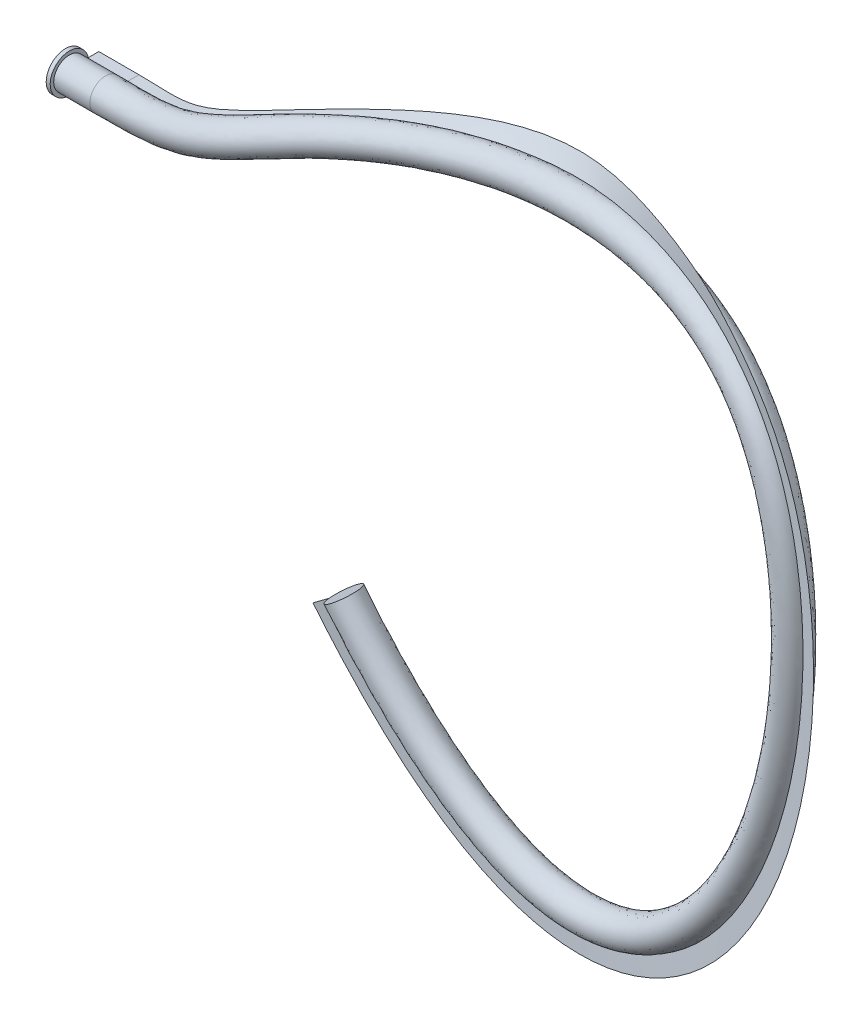
ISO-10303-21;
HEADER;
FILE_DESCRIPTION(('STEP AP214'),'2;1');
FILE_NAME('part.step','',(''),(''),'','','');
FILE_SCHEMA(('AUTOMOTIVE_DESIGN { 1 0 10303 214 1 1 1 1 }'));
ENDSEC;
DATA;
#1=APPLICATION_CONTEXT('core data for automotive mechanical design processes');
#2=APPLICATION_PROTOCOL_DEFINITION('international standard','automotive_design',2000,#1);
#3=PRODUCT_CONTEXT('',#1,'mechanical');
#4=PRODUCT('Part','Part','',(#3));
#5=PRODUCT_RELATED_PRODUCT_CATEGORY('part','',(#4));
#6=PRODUCT_DEFINITION_FORMATION('','',#4);
#7=PRODUCT_DEFINITION_CONTEXT('part definition',#1,'design');
#8=PRODUCT_DEFINITION('design','',#6,#7);
#9=PRODUCT_DEFINITION_SHAPE('','',#8);
#10=(LENGTH_UNIT() NAMED_UNIT(*) SI_UNIT(.MILLI.,.METRE.));
#11=(NAMED_UNIT(*) PLANE_ANGLE_UNIT() SI_UNIT($,.RADIAN.));
#12=(NAMED_UNIT(*) SI_UNIT($,.STERADIAN.) SOLID_ANGLE_UNIT());
#13=UNCERTAINTY_MEASURE_WITH_UNIT(LENGTH_MEASURE(1.E-05),#10,'distance_accuracy_value','');
#14=(GEOMETRIC_REPRESENTATION_CONTEXT(3) GLOBAL_UNCERTAINTY_ASSIGNED_CONTEXT((#13)) GLOBAL_UNIT_ASSIGNED_CONTEXT((#10,
#11,#12)) REPRESENTATION_CONTEXT('',''));
#15=CARTESIAN_POINT('',(0.,0.,0.));
#16=DIRECTION('',(0.,0.,1.));
#17=DIRECTION('',(1.,0.,0.));
#18=AXIS2_PLACEMENT_3D('',#15,#16,#17);
#19=CARTESIAN_POINT('',(0.,0.,0.));
#20=DIRECTION('',(0.,-1.,0.));
#21=DIRECTION('',(0.,0.,-1.));
#22=AXIS2_PLACEMENT_3D('',#19,#20,#21);
#23=PLANE('',#22);
#24=DIRECTION('',(0.,0.,-1.));
#25=VECTOR('',#24,1.);
#26=CARTESIAN_POINT('',(0.,0.,-12.4995326344575));
#27=LINE('',#26,#25);
#28=CARTESIAN_POINT('',(0.,0.,0.));
#29=VERTEX_POINT('',#28);
#30=CARTESIAN_POINT('',(0.,0.,-24.9990652689149));
#31=VERTEX_POINT('',#30);
#32=EDGE_CURVE('E13',#29,#31,#27,.T.);
#33=ORIENTED_EDGE('',*,*,#32,.T.);
#34=DIRECTION('',(1.,0.,0.));
#35=VECTOR('',#34,1.);
#36=CARTESIAN_POINT('',(15.0508166081988,0.,-24.9990652689149));
#37=LINE('',#36,#35);
#38=CARTESIAN_POINT('',(30.1016332163976,0.,-24.9990652689149));
#39=VERTEX_POINT('',#38);
#40=EDGE_CURVE('E111',#31,#39,#37,.T.);
#41=ORIENTED_EDGE('',*,*,#40,.T.);
#42=DIRECTION('',(0.,0.,1.));
#43=VECTOR('',#42,1.);
#44=CARTESIAN_POINT('',(30.1016332163976,0.,-12.4995326344575));
#45=LINE('',#44,#43);
#46=CARTESIAN_POINT('',(30.1016332163976,0.,0.));
#47=VERTEX_POINT('',#46);
#48=EDGE_CURVE('E151',#39,#47,#45,.T.);
#49=ORIENTED_EDGE('',*,*,#48,.T.);
#50=DIRECTION('',(-1.,0.,0.));
#51=VECTOR('',#50,1.);
#52=CARTESIAN_POINT('',(15.0508166081988,0.,0.));
#53=LINE('',#52,#51);
#54=EDGE_CURVE('E153',#47,#29,#53,.T.);
#55=ORIENTED_EDGE('',*,*,#54,.T.);
#56=EDGE_LOOP('',(#33,#41,#49,#55));
#57=FACE_BOUND('',#56,.T.);
#58=ADVANCED_FACE('F103',(#57),#23,.T.);
#59=CARTESIAN_POINT('',(30.1016332163976,0.,0.));
#60=CARTESIAN_POINT('',(55.5468298114233,0.,0.));
#61=CARTESIAN_POINT('',(70.1959087110499,-4.28928661139099,-3.59783484335196));
#62=CARTESIAN_POINT('',(98.3097393803761,-5.5096578882017,-20.1579675410011));
#63=CARTESIAN_POINT('',(113.240531170058,-2.7947658399408,-33.5370180049418));
#64=CARTESIAN_POINT('',(146.632942624987,4.00335387971831,-54.2279027795051));
#65=CARTESIAN_POINT('',(185.690439633622,12.5828522392884,-69.3386516581471));
#66=CARTESIAN_POINT('',(248.064171203921,24.7591159779145,-77.575086725589));
#67=CARTESIAN_POINT('',(312.065258336305,32.7646820646166,-76.0468620606256));
#68=CARTESIAN_POINT('',(362.859164352378,32.6018188310675,-69.7126014350588));
#69=CARTESIAN_POINT('',(399.632211471097,26.355875103229,-63.4546347150911));
#70=CARTESIAN_POINT('',(424.696488528669,18.1098026974709,-58.6273520211944));
#71=CARTESIAN_POINT('',(441.741028211034,8.55596162751169,-55.1355978993468));
#72=CARTESIAN_POINT('',(454.752871671824,-1.67436745328666,-52.4851845901089));
#73=CARTESIAN_POINT('',(468.425955271432,-15.4509263472259,-49.7587908768161));
#74=CARTESIAN_POINT('',(483.768604324146,-39.9448857484107,-46.8472460429881));
#75=CARTESIAN_POINT('',(495.752881352239,-75.3259260325674,-44.7459070807219));
#76=CARTESIAN_POINT('',(501.667481394094,-115.158213425079,-43.8420019327744));
#77=CARTESIAN_POINT('',(501.859614848887,-162.602470687242,-43.9575509822502));
#78=CARTESIAN_POINT('',(494.351450877478,-216.621816096839,-45.2515824799837));
#79=CARTESIAN_POINT('',(477.313875924743,-274.080432822978,-47.6688568933928));
#80=CARTESIAN_POINT('',(452.206924849374,-326.313508699455,-50.6424679806723));
#81=CARTESIAN_POINT('',(423.407944671285,-364.761128649058,-53.3808508663713));
#82=CARTESIAN_POINT('',(393.986523136635,-390.149623686739,-55.5551413090203));
#83=CARTESIAN_POINT('',(366.103223689863,-405.139587422326,-57.1336149651727));
#84=CARTESIAN_POINT('',(335.785348925851,-412.245662508417,-58.2937686026919));
#85=CARTESIAN_POINT('',(306.876826910624,-410.565574709895,-58.8348507950215));
#86=CARTESIAN_POINT('',(280.302523126652,-402.543718859755,-58.8646063924169));
#87=CARTESIAN_POINT('',(256.71553757486,-390.845627953381,-58.5464238900332));
#88=CARTESIAN_POINT('',(232.38779679188,-373.995756595483,-57.8451122645308));
#89=CARTESIAN_POINT('',(207.38755642634,-351.664538797934,-56.7212296929423));
#90=CARTESIAN_POINT('',(181.783072126868,-323.522408572607,-55.1353343523003));
#91=CARTESIAN_POINT('',(164.356090403685,-300.667336145118,-53.7437677305249));
#92=CARTESIAN_POINT('',(155.564644102647,-288.161459197369,-52.9578350171391));
#93=CARTESIAN_POINT('',(30.1016332163976,0.,-24.9990652689149));
#94=CARTESIAN_POINT('',(51.2066463631746,0.,-24.9990652689149));
#95=CARTESIAN_POINT('',(60.0449059639529,-3.90932476682724,-26.1958832214973));
#96=CARTESIAN_POINT('',(83.2787257879151,-5.3902200228475,-40.7047793964273));
#97=CARTESIAN_POINT('',(98.6924087908258,-3.29960154311356,-54.2634156943438));
#98=CARTESIAN_POINT('',(135.151111777136,4.82705807837612,-76.240079899013));
#99=CARTESIAN_POINT('',(179.310164376356,18.1219920870578,-93.5517466398552));
#100=CARTESIAN_POINT('',(244.845057214882,38.460048819118,-99.3036164095549));
#101=CARTESIAN_POINT('',(311.413023428426,56.2856128406427,-87.6747431436239));
#102=CARTESIAN_POINT('',(364.859429325503,57.7203334266527,-72.1518402759851));
#103=CARTESIAN_POINT('',(405.053098130135,50.7783388132778,-61.108660646671));
#104=CARTESIAN_POINT('',(433.517263238505,41.1046699991074,-53.4426134879953));
#105=CARTESIAN_POINT('',(453.70526988275,29.4015121314106,-47.8319429461425));
#106=CARTESIAN_POINT('',(469.601721228006,16.6848629983963,-44.1364201396492));
#107=CARTESIAN_POINT('',(486.545265874564,-0.371148983291283,-40.7305787735882));
#108=CARTESIAN_POINT('',(504.786769619765,-29.5664926385407,-37.5659271811336));
#109=CARTESIAN_POINT('',(518.443484922547,-69.7519116873188,-35.493014717398));
#110=CARTESIAN_POINT('',(525.058221217374,-113.460241850655,-34.948220403716));
#111=CARTESIAN_POINT('',(525.463049713009,-164.498216514142,-35.6773081109705));
#112=CARTESIAN_POINT('',(517.727738561476,-221.937402720238,-37.842007572168));
#113=CARTESIAN_POINT('',(499.901232459371,-282.978143252269,-41.2835331383025));
#114=CARTESIAN_POINT('',(473.195359157688,-339.051462263792,-45.2176151283149));
#115=CARTESIAN_POINT('',(441.691279153495,-381.457632165367,-48.717812231068));
#116=CARTESIAN_POINT('',(408.128267101386,-410.602089225049,-51.5174043528184));
#117=CARTESIAN_POINT('',(375.015442418389,-428.540701366268,-53.6017467679279));
#118=CARTESIAN_POINT('',(337.818430262657,-437.329373265218,-55.1867871496457));
#119=CARTESIAN_POINT('',(302.426537948316,-435.226249596591,-55.9614595510149));
#120=CARTESIAN_POINT('',(270.9549552637,-425.684854795165,-56.0850304806149));
#121=CARTESIAN_POINT('',(243.915939461113,-412.242138102371,-55.7921209009795));
#122=CARTESIAN_POINT('',(216.889464601843,-393.492278179499,-55.0809118143148));
#123=CARTESIAN_POINT('',(189.83854106263,-369.311184940678,-53.9359617089015));
#124=CARTESIAN_POINT('',(162.664859176167,-339.423172383067,-52.3057831277753));
#125=CARTESIAN_POINT('',(144.495964595939,-315.601896564142,-50.9311248144047));
#126=CARTESIAN_POINT('',(135.330804168195,-302.564409375917,-50.1117830181928));
#127=B_SPLINE_SURFACE_WITH_KNOTS('',1,3,((#59,#60,#61,#62,#63,#64,#65,#66,#67,#68,#69,#70,#71,
#72,#73,#74,#75,#76,#77,#78,#79,#80,#81,#82,#83,#84,#85,#86,#87,#88,#89,#90,#91,#92),(#93,#94,
#95,#96,#97,#98,#99,#100,#101,#102,#103,#104,#105,#106,#107,#108,#109,#110,#111,#112,#113,#114,
#115,#116,#117,#118,#119,#120,#121,#122,#123,#124,#125,#126)),.UNSPECIFIED.,.F.,.F.,.F.,(2,2),
(4,1,1,1,1,1,1,1,1,1,1,1,1,1,1,1,1,1,1,1,1,1,1,1,1,1,1,1,1,1,1,4),(0.,1.),(0.,0.052255648091725,
0.052734375,0.10073686332604,0.10546875,0.158203125,0.2109375,0.263671875,0.31640625,
0.3427734375,0.369140625,0.3955078125,0.404157126548899,0.421875,0.45703125,0.4921875,
0.52734375,0.5625,0.609375,0.65625,0.703125,0.75,0.78125,0.8125,0.84375,0.875,0.895833333333333,
0.916666666666667,0.9375,0.958333333333333,0.979166666666667,1.),.UNSPECIFIED.);
#128=CARTESIAN_POINT('',(30.1016332163976,0.,-24.9990652689149));
#129=CARTESIAN_POINT('',(51.2066463631746,0.,-24.9990652689149));
#130=CARTESIAN_POINT('',(60.0449059639529,-3.90932476682724,-26.1958832214973));
#131=CARTESIAN_POINT('',(83.2787257879151,-5.3902200228475,-40.7047793964273));
#132=CARTESIAN_POINT('',(98.6924087908258,-3.29960154311356,-54.2634156943438));
#133=CARTESIAN_POINT('',(135.151111777136,4.82705807837612,-76.240079899013));
#134=CARTESIAN_POINT('',(179.310164376356,18.1219920870578,-93.5517466398552));
#135=CARTESIAN_POINT('',(244.845057214882,38.460048819118,-99.3036164095549));
#136=CARTESIAN_POINT('',(311.413023428426,56.2856128406427,-87.6747431436239));
#137=CARTESIAN_POINT('',(364.859429325503,57.7203334266527,-72.1518402759851));
#138=CARTESIAN_POINT('',(405.053098130135,50.7783388132778,-61.108660646671));
#139=CARTESIAN_POINT('',(433.517263238505,41.1046699991074,-53.4426134879953));
#140=CARTESIAN_POINT('',(453.70526988275,29.4015121314106,-47.8319429461425));
#141=CARTESIAN_POINT('',(469.601721228006,16.6848629983963,-44.1364201396492));
#142=CARTESIAN_POINT('',(486.545265874564,-0.371148983291283,-40.7305787735882));
#143=CARTESIAN_POINT('',(504.786769619765,-29.5664926385407,-37.5659271811336));
#144=CARTESIAN_POINT('',(518.443484922547,-69.7519116873188,-35.493014717398));
#145=CARTESIAN_POINT('',(525.058221217374,-113.460241850655,-34.948220403716));
#146=CARTESIAN_POINT('',(525.463049713009,-164.498216514142,-35.6773081109705));
#147=CARTESIAN_POINT('',(517.727738561476,-221.937402720238,-37.842007572168));
#148=CARTESIAN_POINT('',(499.901232459371,-282.978143252269,-41.2835331383025));
#149=CARTESIAN_POINT('',(473.195359157688,-339.051462263792,-45.2176151283149));
#150=CARTESIAN_POINT('',(441.691279153495,-381.457632165367,-48.717812231068));
#151=CARTESIAN_POINT('',(408.128267101386,-410.602089225049,-51.5174043528184));
#152=CARTESIAN_POINT('',(375.015442418389,-428.540701366268,-53.6017467679279));
#153=CARTESIAN_POINT('',(337.818430262657,-437.329373265218,-55.1867871496457));
#154=CARTESIAN_POINT('',(302.426537948316,-435.226249596591,-55.9614595510149));
#155=CARTESIAN_POINT('',(270.9549552637,-425.684854795165,-56.0850304806149));
#156=CARTESIAN_POINT('',(243.915939461113,-412.242138102371,-55.7921209009795));
#157=CARTESIAN_POINT('',(216.889464601843,-393.492278179499,-55.0809118143148));
#158=CARTESIAN_POINT('',(189.83854106263,-369.311184940678,-53.9359617089015));
#159=CARTESIAN_POINT('',(162.664859176167,-339.423172383067,-52.3057831277753));
#160=CARTESIAN_POINT('',(144.495964595939,-315.601896564142,-50.9311248144047));
#161=CARTESIAN_POINT('',(135.330804168195,-302.564409375917,-50.1117830181928));
#162=B_SPLINE_CURVE_WITH_KNOTS('',3,(#128,#129,#130,#131,#132,#133,#134,#135,#136,#137,#138,
#139,#140,#141,#142,#143,#144,#145,#146,#147,#148,#149,#150,#151,#152,#153,#154,#155,#156,#157,
#158,#159,#160,#161),.UNSPECIFIED.,.F.,.F.,(4,1,1,1,1,1,1,1,1,1,1,1,1,1,1,1,1,1,1,1,1,1,1,1,1,1,
1,1,1,1,1,4),(0.,0.052255648091725,0.052734375,0.10073686332604,0.10546875,0.158203125,
0.2109375,0.263671875,0.31640625,0.3427734375,0.369140625,0.3955078125,0.404157126548899,
0.421875,0.45703125,0.4921875,0.52734375,0.5625,0.609375,0.65625,0.703125,0.75,0.78125,0.8125,
0.84375,0.875,0.895833333333333,0.916666666666667,0.9375,0.958333333333333,0.979166666666667,
1.),.UNSPECIFIED.);
#163=CARTESIAN_POINT('',(135.330804168195,-302.564409375917,-50.1117830181928));
#164=VERTEX_POINT('',#163);
#165=EDGE_CURVE('E132',#39,#164,#162,.T.);
#166=DIRECTION('',(0.809383859628205,0.57613954856375,-0.113846336586242));
#167=VECTOR('',#166,1.);
#168=CARTESIAN_POINT('',(145.447724135421,-295.362934286643,-51.534809017666));
#169=LINE('',#168,#167);
#170=CARTESIAN_POINT('',(155.564644102647,-288.161459197369,-52.9578350171391));
#171=VERTEX_POINT('',#170);
#172=EDGE_CURVE('E105',#164,#171,#169,.T.);
#173=CARTESIAN_POINT('',(30.1016332163976,0.,0.));
#174=CARTESIAN_POINT('',(55.5468298114233,0.,0.));
#175=CARTESIAN_POINT('',(70.1959087110499,-4.28928661139099,-3.59783484335196));
#176=CARTESIAN_POINT('',(98.3097393803761,-5.5096578882017,-20.1579675410011));
#177=CARTESIAN_POINT('',(113.240531170058,-2.7947658399408,-33.5370180049418));
#178=CARTESIAN_POINT('',(146.632942624987,4.00335387971831,-54.2279027795051));
#179=CARTESIAN_POINT('',(185.690439633622,12.5828522392884,-69.3386516581471));
#180=CARTESIAN_POINT('',(248.064171203921,24.7591159779145,-77.575086725589));
#181=CARTESIAN_POINT('',(312.065258336305,32.7646820646166,-76.0468620606256));
#182=CARTESIAN_POINT('',(362.859164352378,32.6018188310675,-69.7126014350588));
#183=CARTESIAN_POINT('',(399.632211471097,26.355875103229,-63.4546347150911));
#184=CARTESIAN_POINT('',(424.696488528669,18.1098026974709,-58.6273520211944));
#185=CARTESIAN_POINT('',(441.741028211034,8.55596162751169,-55.1355978993468));
#186=CARTESIAN_POINT('',(454.752871671824,-1.67436745328666,-52.4851845901089));
#187=CARTESIAN_POINT('',(468.425955271432,-15.4509263472259,-49.7587908768161));
#188=CARTESIAN_POINT('',(483.768604324146,-39.9448857484107,-46.8472460429881));
#189=CARTESIAN_POINT('',(495.752881352239,-75.3259260325674,-44.7459070807219));
#190=CARTESIAN_POINT('',(501.667481394094,-115.158213425079,-43.8420019327744));
#191=CARTESIAN_POINT('',(501.859614848887,-162.602470687242,-43.9575509822502));
#192=CARTESIAN_POINT('',(494.351450877478,-216.621816096839,-45.2515824799837));
#193=CARTESIAN_POINT('',(477.313875924743,-274.080432822978,-47.6688568933928));
#194=CARTESIAN_POINT('',(452.206924849374,-326.313508699455,-50.6424679806723));
#195=CARTESIAN_POINT('',(423.407944671285,-364.761128649058,-53.3808508663713));
#196=CARTESIAN_POINT('',(393.986523136635,-390.149623686739,-55.5551413090203));
#197=CARTESIAN_POINT('',(366.103223689863,-405.139587422326,-57.1336149651727));
#198=CARTESIAN_POINT('',(335.785348925851,-412.245662508417,-58.2937686026919));
#199=CARTESIAN_POINT('',(306.876826910624,-410.565574709895,-58.8348507950215));
#200=CARTESIAN_POINT('',(280.302523126652,-402.543718859755,-58.8646063924169));
#201=CARTESIAN_POINT('',(256.71553757486,-390.845627953381,-58.5464238900332));
#202=CARTESIAN_POINT('',(232.38779679188,-373.995756595483,-57.8451122645308));
#203=CARTESIAN_POINT('',(207.38755642634,-351.664538797934,-56.7212296929423));
#204=CARTESIAN_POINT('',(181.783072126868,-323.522408572607,-55.1353343523003));
#205=CARTESIAN_POINT('',(164.356090403685,-300.667336145118,-53.7437677305249));
#206=CARTESIAN_POINT('',(155.564644102647,-288.161459197369,-52.9578350171391));
#207=B_SPLINE_CURVE_WITH_KNOTS('',3,(#173,#174,#175,#176,#177,#178,#179,#180,#181,#182,#183,
#184,#185,#186,#187,#188,#189,#190,#191,#192,#193,#194,#195,#196,#197,#198,#199,#200,#201,#202,
#203,#204,#205,#206),.UNSPECIFIED.,.F.,.F.,(4,1,1,1,1,1,1,1,1,1,1,1,1,1,1,1,1,1,1,1,1,1,1,1,1,1,
1,1,1,1,1,4),(0.,0.052255648091725,0.052734375,0.10073686332604,0.10546875,0.158203125,
0.2109375,0.263671875,0.31640625,0.3427734375,0.369140625,0.3955078125,0.404157126548899,
0.421875,0.45703125,0.4921875,0.52734375,0.5625,0.609375,0.65625,0.703125,0.75,0.78125,0.8125,
0.84375,0.875,0.895833333333333,0.916666666666667,0.9375,0.958333333333333,0.979166666666667,
1.),.UNSPECIFIED.);
#208=EDGE_CURVE('E120',#171,#47,#207,.F.);
#209=ORIENTED_EDGE('',*,*,#48,.F.);
#210=ORIENTED_EDGE('',*,*,#165,.T.);
#211=ORIENTED_EDGE('',*,*,#172,.T.);
#212=ORIENTED_EDGE('',*,*,#208,.T.);
#213=EDGE_LOOP('',(#209,#210,#211,#212));
#214=FACE_BOUND('',#213,.T.);
#215=ADVANCED_FACE('F134',(#214),#127,.T.);
#216=OPEN_SHELL('',(#58,#215));
#217=SHELL_BASED_SURFACE_MODEL('B2',(#216));
#218=CARTESIAN_POINT('',(0.,0.,0.));
#219=DIRECTION('',(1.,0.,0.));
#220=DIRECTION('',(0.,0.,-1.));
#221=AXIS2_PLACEMENT_3D('',#218,#219,#220);
#222=CYLINDRICAL_SURFACE('',#221,11.798578456208);
#223=CARTESIAN_POINT('',(30.1016332163976,0.,0.));
#224=DIRECTION('',(1.,0.,0.));
#225=DIRECTION('',(0.,0.,-1.));
#226=AXIS2_PLACEMENT_3D('',#223,#224,#225);
#227=CIRCLE('',#226,11.798578456208);
#228=CARTESIAN_POINT('',(30.1016332163976,0.,-11.798578456208));
#229=VERTEX_POINT('',#228);
#230=EDGE_CURVE('E102',#229,#229,#227,.T.);
#231=ORIENTED_EDGE('',*,*,#230,.F.);
#232=EDGE_LOOP('',(#231));
#233=FACE_BOUND('',#232,.T.);
#234=CARTESIAN_POINT('',(3.,0.,0.));
#235=DIRECTION('',(-1.,0.,0.));
#236=DIRECTION('',(0.,0.,1.));
#237=AXIS2_PLACEMENT_3D('',#234,#235,#236);
#238=CIRCLE('',#237,11.798578456208);
#239=CARTESIAN_POINT('',(3.,0.,11.798578456208));
#240=VERTEX_POINT('',#239);
#241=EDGE_CURVE('E199',#240,#240,#238,.F.);
#242=ORIENTED_EDGE('',*,*,#241,.T.);
#243=EDGE_LOOP('',(#242));
#244=FACE_BOUND('',#243,.T.);
#245=ADVANCED_FACE('F196',(#233,#244),#222,.T.);
#246=CARTESIAN_POINT('',(155.564644102647,-288.161459197368,-52.9578350171388));
#247=DIRECTION('',(-0.574341651577695,0.817003912058257,0.0513446681215159));
#248=DIRECTION('',(-0.809383859628204,-0.576139548563751,0.113846336586242));
#249=AXIS2_PLACEMENT_3D('',#246,#247,#248);
#250=PLANE('',#249);
#251=CARTESIAN_POINT('',(155.564644102647,-288.161459197368,-52.9578350171388));
#252=DIRECTION('',(-0.574341651577695,0.817003912058257,0.0513446681215159));
#253=DIRECTION('',(-0.809383859628204,-0.576139548563751,0.113846336586242));
#254=AXIS2_PLACEMENT_3D('',#251,#252,#253);
#255=CIRCLE('',#254,11.798578456208);
#256=CARTESIAN_POINT('',(146.015065133636,-294.959086862822,-51.6146100829742));
#257=VERTEX_POINT('',#256);
#258=EDGE_CURVE('E203',#257,#257,#255,.T.);
#259=ORIENTED_EDGE('',*,*,#258,.T.);
#260=EDGE_LOOP('',(#259));
#261=FACE_BOUND('',#260,.T.);
#262=ADVANCED_FACE('F234',(#261),#250,.T.);
#263=CARTESIAN_POINT('',(30.1016332163976,0.,-11.798578456208));
#264=CARTESIAN_POINT('',(55.5476186814989,0.,-11.798578456208));
#265=CARTESIAN_POINT('',(65.9728837938179,-4.10995952114873,-14.2632274841827));
#266=CARTESIAN_POINT('',(90.708402752645,-5.45328789956953,-29.8552569833641));
#267=CARTESIAN_POINT('',(106.189518537636,-3.03302849445633,-43.3190649183939));
#268=CARTESIAN_POINT('',(141.372193254795,4.39210995951688,-64.6167871614904));
#269=CARTESIAN_POINT('',(182.610284980642,15.1971090273244,-80.7662829610074));
#270=CARTESIAN_POINT('',(246.563370788906,31.2254189900988,-87.8301006413731));
#271=CARTESIAN_POINT('',(311.752363380052,43.8656390059569,-81.534765938688));
#272=CARTESIAN_POINT('',(363.803839603014,44.4567726851997,-70.8638265120173));
#273=CARTESIAN_POINT('',(402.190538998434,37.8823202353672,-62.3474269533313));
#274=CARTESIAN_POINT('',(428.85957998228,28.962478308741,-56.1803587556124));
#275=CARTESIAN_POINT('',(447.387681668277,18.3942439967641,-51.6885591778793));
#276=CARTESIAN_POINT('',(461.760942532586,6.99046935360578,-48.5448951704222));
#277=CARTESIAN_POINT('',(476.977562061572,-8.33386279236788,-45.4978288098984));
#278=CARTESIAN_POINT('',(493.688353176079,-35.0466911945485,-42.4668275117174));
#279=CARTESIAN_POINT('',(506.461956662736,-72.6952098487024,-40.3789047419473));
#280=CARTESIAN_POINT('',(512.70699324683,-114.356837431132,-39.6444858252541));
#281=CARTESIAN_POINT('',(512.999510501614,-163.497188364772,-40.0496010601912));
#282=CARTESIAN_POINT('',(505.384141981025,-219.130564581928,-41.7545536969235));
#283=CARTESIAN_POINT('',(487.974222301005,-278.279803024488,-44.6552344724933));
#284=CARTESIAN_POINT('',(462.112643276519,-332.325323976446,-48.0821502178843));
#285=CARTESIAN_POINT('',(432.036959934697,-372.641221239419,-51.1800793488499));
#286=CARTESIAN_POINT('',(400.660875571386,-399.802390856563,-53.6494881525222));
#287=CARTESIAN_POINT('',(370.309426836316,-416.183974754221,-55.4667103751569));
#288=CARTESIAN_POINT('',(336.744938115023,-424.084267879704,-56.8274000731981));
#289=CARTESIAN_POINT('',(304.776290201757,-422.20419746656,-57.4787071791582));
#290=CARTESIAN_POINT('',(275.891253557448,-413.466019139512,-57.5527927442225));
#291=CARTESIAN_POINT('',(250.673056086035,-400.941703895352,-57.2463602575154));
#292=CARTESIAN_POINT('',(225.079068367196,-383.205709702508,-56.5410434039459));
#293=CARTESIAN_POINT('',(199.083176112729,-359.9618635885,-55.4047316534655));
#294=CARTESIAN_POINT('',(172.841881771136,-331.143386717085,-53.8072148908379));
#295=CARTESIAN_POINT('',(154.806513688038,-307.464967015995,-52.4005429978053));
#296=CARTESIAN_POINT('',(146.015065133635,-294.959086862822,-51.6146100829745));
#297=CARTESIAN_POINT('',(30.1016332163976,23.597156912416,-11.798578456208));
#298=CARTESIAN_POINT('',(61.6990032516399,23.597156912416,-11.798578456208));
#299=CARTESIAN_POINT('',(69.1180638556201,19.5248925409228,-14.7724994981416));
#300=CARTESIAN_POINT('',(89.480992149267,18.0801107091123,-29.8335300343747));
#301=CARTESIAN_POINT('',(103.402810919764,20.3614445748145,-42.2754654121536));
#302=CARTESIAN_POINT('',(137.453928832869,27.5014063665857,-61.2876276357711));
#303=CARTESIAN_POINT('',(179.778513551476,38.0167931203063,-74.9029422551506));
#304=CARTESIAN_POINT('',(244.223850313923,51.6289655759233,-74.5621432484984));
#305=CARTESIAN_POINT('',(309.838131783552,54.6799028942448,-59.4472749434804));
#306=CARTESIAN_POINT('',(360.824837232796,46.9223017848143,-47.3907313807583));
#307=CARTESIAN_POINT('',(397.766698271059,36.6042568014699,-39.1616869682762));
#308=CARTESIAN_POINT('',(423.161280867935,25.9609889426634,-33.4444873180707));
#309=CARTESIAN_POINT('',(440.3902052791,14.5758260465204,-29.4738227582075));
#310=CARTESIAN_POINT('',(453.993432887083,3.26029429315646,-26.571808462533));
#311=CARTESIAN_POINT('',(468.584277676536,-11.4746082442471,-23.6615953378242));
#312=CARTESIAN_POINT('',(484.997085778159,-37.1683091827344,-20.6214356729075));
#313=CARTESIAN_POINT('',(497.758018884046,-73.8456595230765,-18.4702081929353));
#314=CARTESIAN_POINT('',(504.315360649713,-114.728273258422,-17.5878918251665));
#315=CARTESIAN_POINT('',(505.178609159269,-163.211099156859,-17.7813880837857));
#316=CARTESIAN_POINT('',(498.389949883388,-218.331431214289,-19.2228945684598));
#317=CARTESIAN_POINT('',(481.962006930384,-277.083517169354,-21.8598855982213));
#318=CARTESIAN_POINT('',(457.056861527401,-330.759160790736,-25.0784369887839));
#319=CARTESIAN_POINT('',(427.85487930872,-370.650604108366,-28.034134821229));
#320=CARTESIAN_POINT('',(397.428854959249,-397.361117382589,-30.3954130742282));
#321=CARTESIAN_POINT('',(368.120529038991,-413.382359597642,-32.1284480941093));
#322=CARTESIAN_POINT('',(335.840583727827,-421.128019185759,-33.4208310891567));
#323=CARTESIAN_POINT('',(305.042187147079,-419.43733555091,-34.037710515772));
#324=CARTESIAN_POINT('',(277.023127943738,-411.06303121489,-34.1017819824482));
#325=CARTESIAN_POINT('',(252.394842545483,-398.913328031947,-33.7960557231714));
#326=CARTESIAN_POINT('',(227.271988210579,-381.606937120433,-33.0997544147405));
#327=CARTESIAN_POINT('',(201.528435107923,-358.647963823217,-31.9663531617896));
#328=CARTESIAN_POINT('',(175.805243041149,-330.569818551074,-30.4053195043266));
#329=CARTESIAN_POINT('',(157.170276217859,-306.149989019511,-28.9408327516767));
#330=CARTESIAN_POINT('',(148.907949058601,-294.396786734294,-28.2022019302168));
#331=CARTESIAN_POINT('',(30.1016332163976,23.597156912416,11.798578456208));
#332=CARTESIAN_POINT('',(61.6990032516399,23.597156912416,11.798578456208));
#333=CARTESIAN_POINT('',(77.5645508981014,19.1662383604382,6.55828578351985));
#334=CARTESIAN_POINT('',(104.68327482603,17.967370731848,-10.4389511496488));
#335=CARTESIAN_POINT('',(117.504693847138,20.8379698838456,-22.7113715852493));
#336=CARTESIAN_POINT('',(147.975549395907,26.7238942069885,-40.5098588718006));
#337=CARTESIAN_POINT('',(185.938769797391,32.7882795442343,-52.0476796494301));
#338=CARTESIAN_POINT('',(247.225465384021,38.6963595515546,-54.0521154169302));
#339=CARTESIAN_POINT('',(310.463917795829,32.4779890115643,-48.4714671873558));
#340=CARTESIAN_POINT('',(358.935487215523,23.2123940765498,-45.0882812268412));
#341=CARTESIAN_POINT('',(392.650043125229,13.5513665371934,-41.376102491796));
#342=CARTESIAN_POINT('',(414.835097985122,4.2556377201231,-38.3384738492346));
#343=CARTESIAN_POINT('',(429.096898365055,-5.10073869198444,-36.3679002011426));
#344=CARTESIAN_POINT('',(439.977291162615,-14.0693793206284,-34.4523873019063));
#345=CARTESIAN_POINT('',(451.481064098369,-25.7087353539631,-32.1835194716595));
#346=CARTESIAN_POINT('',(465.157588073577,-46.9646982904589,-29.382272735449));
#347=CARTESIAN_POINT('',(476.339868263243,-79.1070918908066,-27.2042128704844));
#348=CARTESIAN_POINT('',(482.236336944189,-116.331025246315,-25.9829240402071));
#349=CARTESIAN_POINT('',(482.898817853835,-161.421663801798,-25.5972879279039));
#350=CARTESIAN_POINT('',(476.324567676287,-213.31393424411,-26.2169521345801));
#351=CARTESIAN_POINT('',(460.641314177864,-268.684776766339,-27.8871304400206));
#352=CARTESIAN_POINT('',(437.245424673097,-318.735530236735,-30.1990725143588));
#353=CARTESIAN_POINT('',(410.596848781938,-354.890418927704,-32.4356778562756));
#354=CARTESIAN_POINT('',(384.080150089649,-378.055583042801,-34.2067193872156));
#355=CARTESIAN_POINT('',(359.708122746458,-391.293584934384,-35.4622572741742));
#356=CARTESIAN_POINT('',(333.921405348089,-397.450808441202,-36.3535681480196));
#357=CARTESIAN_POINT('',(309.243260569279,-396.160090043935,-36.749997747898));
#358=CARTESIAN_POINT('',(285.845667071519,-389.21843064026,-36.7254092778872));
#359=CARTESIAN_POINT('',(264.47980556333,-378.721176205184,-36.3961829918006));
#360=CARTESIAN_POINT('',(241.88944490979,-363.187030692783,-35.7078921224866));
#361=CARTESIAN_POINT('',(218.137196295579,-342.053315039307,-34.5993492908447));
#362=CARTESIAN_POINT('',(193.687621661034,-315.327859286835,-33.0615582402694));
#363=CARTESIAN_POINT('',(176.269434155882,-292.554733688604,-31.627282620006));
#364=CARTESIAN_POINT('',(168.007106996625,-280.801531403386,-30.8886517985461));
#365=CARTESIAN_POINT('',(30.1016332163976,0.,11.798578456208));
#366=CARTESIAN_POINT('',(58.6233109665694,0.,11.798578456208));
#367=CARTESIAN_POINT('',(75.2716767910484,-4.46861370163325,7.06755779747876));
#368=CARTESIAN_POINT('',(105.149280016965,-5.56602787683386,-10.4606780986382));
#369=CARTESIAN_POINT('',(120.013924683349,-2.55650318542527,-23.7549710914896));
#370=CARTESIAN_POINT('',(152.131298421776,3.61459779991973,-43.8390183975199));
#371=CARTESIAN_POINT('',(188.667104438622,9.96859545125235,-57.9110203552869));
#372=CARTESIAN_POINT('',(249.592745860649,18.2928129657302,-67.3200728098049));
#373=CARTESIAN_POINT('',(312.370546173687,21.6637251232762,-70.5589581825633));
#374=CARTESIAN_POINT('',(361.915433110073,20.7468649769357,-68.5613763581002));
#375=CARTESIAN_POINT('',(397.073706152537,14.8294299710899,-64.5618424768511));
#376=CARTESIAN_POINT('',(420.533444681506,7.25712708620385,-61.0743452867761));
#377=CARTESIAN_POINT('',(436.094375612544,-1.28232074174921,-58.5826366208149));
#378=CARTESIAN_POINT('',(447.744795067388,-10.3392042601661,-56.4254740097948));
#379=CARTESIAN_POINT('',(459.874352600762,-22.5679899020612,-54.0197529437323));
#380=CARTESIAN_POINT('',(473.848854075864,-44.8430803025324,-51.2276645742752));
#381=CARTESIAN_POINT('',(485.043806415011,-77.9566422154731,-49.1129094194362));
#382=CARTESIAN_POINT('',(490.627969444629,-115.959589422603,-48.0395180405195));
#383=CARTESIAN_POINT('',(490.719719222068,-161.707752994479,-47.865500903352));
#384=CARTESIAN_POINT('',(483.318759818007,-214.113067690056,-48.748611267965));
#385=CARTESIAN_POINT('',(466.653529347919,-269.881062331983,-50.6824792960995));
#386=CARTESIAN_POINT('',(442.301207180397,-320.3016945021,-53.2027858113102));
#387=CARTESIAN_POINT('',(414.77892697468,-356.881032597273,-55.5816221663593));
#388=CARTESIAN_POINT('',(387.312176490026,-380.496864750618,-57.4607949829661));
#389=CARTESIAN_POINT('',(361.896998649562,-394.095168946311,-58.8005175979341));
#390=CARTESIAN_POINT('',(334.825841523927,-400.407173479908,-59.7601444437557));
#391=CARTESIAN_POINT('',(308.977101369055,-398.926578900656,-60.1909709663696));
#392=CARTESIAN_POINT('',(284.714416515792,-391.622305967021,-60.1764758085111));
#393=CARTESIAN_POINT('',(262.755659452895,-380.746195453093,-59.8462765794084));
#394=CARTESIAN_POINT('',(239.705339839792,-364.798342334702,-59.1499691297869));
#395=CARTESIAN_POINT('',(215.659037857831,-343.320415180711,-58.0347866568775));
#396=CARTESIAN_POINT('',(190.847043387853,-316.076086888516,-56.4744301112583));
#397=CARTESIAN_POINT('',(173.641110928489,-293.49337275111,-55.0633418194491));
#398=CARTESIAN_POINT('',(165.114223071659,-281.363831531915,-54.3010599513038));
#399=CARTESIAN_POINT('',(30.1016332163976,-23.597156912416,11.798578456208));
#400=CARTESIAN_POINT('',(55.5476186814989,-23.597156912416,11.798578456208));
#401=CARTESIAN_POINT('',(72.9788026839956,-28.1034657637048,7.57682981143767));
#402=CARTESIAN_POINT('',(105.6152852079,-29.0994264855157,-10.4824050476275));
#403=CARTESIAN_POINT('',(122.523155519559,-25.9509762546961,-24.79857059773));
#404=CARTESIAN_POINT('',(156.287047447645,-19.494698607149,-47.1681779232392));
#405=CARTESIAN_POINT('',(191.395439079853,-12.8510886417296,-63.7743610611436));
#406=CARTESIAN_POINT('',(251.960026337277,-2.11073362009424,-80.5880302026796));
#407=CARTESIAN_POINT('',(314.277174551544,10.8494612349882,-92.6464491777708));
#408=CARTESIAN_POINT('',(364.895379004622,18.2813358773216,-92.0344714893592));
#409=CARTESIAN_POINT('',(401.497369179844,16.1074934049864,-87.7475824619062));
#410=CARTESIAN_POINT('',(426.23179137789,10.2586164522846,-83.8102167243177));
#411=CARTESIAN_POINT('',(443.091852860034,2.53609720848602,-80.7973730404873));
#412=CARTESIAN_POINT('',(455.512298972162,-6.60902919970383,-78.3985607176832));
#413=CARTESIAN_POINT('',(468.267641103155,-19.4272444501593,-75.8559864158051));
#414=CARTESIAN_POINT('',(482.540120078151,-42.7214623146059,-73.0730564131013));
#415=CARTESIAN_POINT('',(493.747744566778,-76.8061925401396,-71.021605968388));
#416=CARTESIAN_POINT('',(499.019601945069,-115.588153598891,-70.0961120408319));
#417=CARTESIAN_POINT('',(498.540620590302,-161.99384218716,-70.1337138788001));
#418=CARTESIAN_POINT('',(490.312951959727,-214.912201136002,-71.2802704013498));
#419=CARTESIAN_POINT('',(472.665744517974,-271.077347897626,-73.4778281521785));
#420=CARTESIAN_POINT('',(447.356989687698,-321.867858767464,-76.2064991082615));
#421=CARTESIAN_POINT('',(418.961005167421,-358.871646266843,-78.727566476443));
#422=CARTESIAN_POINT('',(390.544202890403,-382.938146458436,-80.7148705787165));
#423=CARTESIAN_POINT('',(364.085874552667,-396.896752958238,-82.1387779216939));
#424=CARTESIAN_POINT('',(335.730277699765,-403.363538518613,-83.1667207394918));
#425=CARTESIAN_POINT('',(308.710942168831,-401.693067757376,-83.6319441848413));
#426=CARTESIAN_POINT('',(283.583165960065,-394.026181293783,-83.627542339135));
#427=CARTESIAN_POINT('',(261.03151334246,-382.771214701003,-83.2963701670162));
#428=CARTESIAN_POINT('',(237.521234769794,-366.409653976621,-82.5920461370871));
#429=CARTESIAN_POINT('',(213.180879420083,-344.587515322115,-81.4702240229103));
#430=CARTESIAN_POINT('',(188.006465114673,-316.824314490197,-79.8873019822472));
#431=CARTESIAN_POINT('',(171.012787701095,-294.432011813617,-78.4994010188922));
#432=CARTESIAN_POINT('',(162.221339146692,-281.926131660444,-77.7134681040614));
#433=CARTESIAN_POINT('',(30.1016332163976,-23.597156912416,-11.798578456208));
#434=CARTESIAN_POINT('',(49.3962341113579,-23.597156912416,-11.798578456208));
#435=CARTESIAN_POINT('',(62.8277037320158,-27.7448115832202,-13.7539554702238));
#436=CARTESIAN_POINT('',(91.935813356023,-28.9866865082514,-29.8769839323534));
#437=CARTESIAN_POINT('',(108.976226155508,-26.4275015637272,-44.3626644246343));
#438=CARTESIAN_POINT('',(145.290457676721,-18.7171864475519,-67.9459466872097));
#439=CARTESIAN_POINT('',(185.442056409808,-7.6225750656576,-86.6296236668641));
#440=CARTESIAN_POINT('',(248.90289126389,10.8218724042743,-101.098058034248));
#441=CARTESIAN_POINT('',(313.666594976552,33.051375117669,-103.622256933895));
#442=CARTESIAN_POINT('',(366.782841973232,41.9912435855851,-94.3369216432763));
#443=CARTESIAN_POINT('',(406.614379725809,39.1603836692645,-85.5331669383863));
#444=CARTESIAN_POINT('',(434.557879096625,31.9639676748186,-78.9162301931542));
#445=CARTESIAN_POINT('',(454.385158057453,22.2126619470078,-73.9032955975511));
#446=CARTESIAN_POINT('',(469.528452178088,10.7206444140551,-70.5179818783115));
#447=CARTESIAN_POINT('',(485.370846446607,-5.19311734048871,-67.3340622819727));
#448=CARTESIAN_POINT('',(502.379620573999,-32.9250732063625,-64.3122193505272));
#449=CARTESIAN_POINT('',(515.165894441426,-71.5447601743282,-62.2876012909594));
#450=CARTESIAN_POINT('',(521.098625843948,-113.985401603842,-61.7010798253416));
#451=CARTESIAN_POINT('',(520.820411843959,-163.783277572686,-62.3178140365966));
#452=CARTESIAN_POINT('',(512.378334078662,-219.929697949567,-64.2862128253871));
#453=CARTESIAN_POINT('',(493.986437671627,-279.476088879622,-67.4505833467653));
#454=CARTESIAN_POINT('',(467.168425025637,-333.891487162157,-71.0858634469846));
#455=CARTESIAN_POINT('',(436.219040560674,-374.631838370472,-74.3260238764708));
#456=CARTESIAN_POINT('',(403.892896183522,-402.243664330537,-76.9035632308161));
#457=CARTESIAN_POINT('',(372.498324633641,-418.985589910799,-78.8049726562045));
#458=CARTESIAN_POINT('',(337.64929250222,-427.040516573649,-80.2339690572396));
#459=CARTESIAN_POINT('',(304.510393256436,-424.971059382211,-80.9197038425444));
#460=CARTESIAN_POINT('',(274.759379171158,-415.869007064134,-81.0038035059967));
#461=CARTESIAN_POINT('',(248.951269626587,-402.970079758757,-80.6966647918593));
#462=CARTESIAN_POINT('',(222.886148523813,-384.804482284583,-79.9823323931513));
#463=CARTESIAN_POINT('',(196.637917117536,-361.275763353783,-78.8431101451413));
#464=CARTESIAN_POINT('',(169.878520501123,-331.716954883096,-77.2091102773493));
#465=CARTESIAN_POINT('',(152.442751158217,-308.779945012479,-75.8602532439339));
#466=CARTESIAN_POINT('',(143.122181208669,-295.521386991351,-75.0270182357321));
#467=CARTESIAN_POINT('',(30.1016332163976,0.,-11.798578456208));
#468=CARTESIAN_POINT('',(55.5476186814989,0.,-11.798578456208));
#469=CARTESIAN_POINT('',(65.9728837938179,-4.10995952114873,-14.2632274841827));
#470=CARTESIAN_POINT('',(90.708402752645,-5.45328789956953,-29.8552569833641));
#471=CARTESIAN_POINT('',(106.189518537636,-3.03302849445633,-43.3190649183939));
#472=CARTESIAN_POINT('',(141.372193254795,4.39210995951688,-64.6167871614904));
#473=CARTESIAN_POINT('',(182.610284980642,15.1971090273244,-80.7662829610074));
#474=CARTESIAN_POINT('',(246.563370788906,31.2254189900988,-87.8301006413731));
#475=CARTESIAN_POINT('',(311.752363380052,43.8656390059569,-81.534765938688));
#476=CARTESIAN_POINT('',(363.803839603014,44.4567726851997,-70.8638265120173));
#477=CARTESIAN_POINT('',(402.190538998434,37.8823202353672,-62.3474269533313));
#478=CARTESIAN_POINT('',(428.85957998228,28.962478308741,-56.1803587556124));
#479=CARTESIAN_POINT('',(447.387681668277,18.3942439967641,-51.6885591778793));
#480=CARTESIAN_POINT('',(461.760942532586,6.99046935360578,-48.5448951704222));
#481=CARTESIAN_POINT('',(476.977562061572,-8.33386279236788,-45.4978288098984));
#482=CARTESIAN_POINT('',(493.688353176079,-35.0466911945485,-42.4668275117174));
#483=CARTESIAN_POINT('',(506.461956662736,-72.6952098487024,-40.3789047419473));
#484=CARTESIAN_POINT('',(512.70699324683,-114.356837431132,-39.6444858252541));
#485=CARTESIAN_POINT('',(512.999510501614,-163.497188364772,-40.0496010601912));
#486=CARTESIAN_POINT('',(505.384141981025,-219.130564581928,-41.7545536969235));
#487=CARTESIAN_POINT('',(487.974222301005,-278.279803024488,-44.6552344724933));
#488=CARTESIAN_POINT('',(462.112643276519,-332.325323976446,-48.0821502178843));
#489=CARTESIAN_POINT('',(432.036959934697,-372.641221239419,-51.1800793488499));
#490=CARTESIAN_POINT('',(400.660875571386,-399.802390856563,-53.6494881525222));
#491=CARTESIAN_POINT('',(370.309426836316,-416.183974754221,-55.4667103751569));
#492=CARTESIAN_POINT('',(336.744938115023,-424.084267879704,-56.8274000731981));
#493=CARTESIAN_POINT('',(304.776290201757,-422.20419746656,-57.4787071791582));
#494=CARTESIAN_POINT('',(275.891253557448,-413.466019139512,-57.5527927442225));
#495=CARTESIAN_POINT('',(250.673056086035,-400.941703895352,-57.2463602575154));
#496=CARTESIAN_POINT('',(225.079068367196,-383.205709702508,-56.5410434039459));
#497=CARTESIAN_POINT('',(199.083176112729,-359.9618635885,-55.4047316534655));
#498=CARTESIAN_POINT('',(172.841881771136,-331.143386717085,-53.8072148908379));
#499=CARTESIAN_POINT('',(154.806513688038,-307.464967015995,-52.4005429978053));
#500=CARTESIAN_POINT('',(146.015065133635,-294.959086862822,-51.6146100829745));
#501=(BOUNDED_SURFACE() B_SPLINE_SURFACE(3,3,((#263,#264,#265,#266,#267,#268,#269,#270,#271,
#272,#273,#274,#275,#276,#277,#278,#279,#280,#281,#282,#283,#284,#285,#286,#287,#288,#289,#290,
#291,#292,#293,#294,#295,#296),(#297,#298,#299,#300,#301,#302,#303,#304,#305,#306,#307,#308,
#309,#310,#311,#312,#313,#314,#315,#316,#317,#318,#319,#320,#321,#322,#323,#324,#325,#326,#327,
#328,#329,#330),(#331,#332,#333,#334,#335,#336,#337,#338,#339,#340,#341,#342,#343,#344,#345,
#346,#347,#348,#349,#350,#351,#352,#353,#354,#355,#356,#357,#358,#359,#360,#361,#362,#363,#364),
(#365,#366,#367,#368,#369,#370,#371,#372,#373,#374,#375,#376,#377,#378,#379,#380,#381,#382,#383,
#384,#385,#386,#387,#388,#389,#390,#391,#392,#393,#394,#395,#396,#397,#398),(#399,#400,#401,
#402,#403,#404,#405,#406,#407,#408,#409,#410,#411,#412,#413,#414,#415,#416,#417,#418,#419,#420,
#421,#422,#423,#424,#425,#426,#427,#428,#429,#430,#431,#432),(#433,#434,#435,#436,#437,#438,
#439,#440,#441,#442,#443,#444,#445,#446,#447,#448,#449,#450,#451,#452,#453,#454,#455,#456,#457,
#458,#459,#460,#461,#462,#463,#464,#465,#466),(#467,#468,#469,#470,#471,#472,#473,#474,#475,
#476,#477,#478,#479,#480,#481,#482,#483,#484,#485,#486,#487,#488,#489,#490,#491,#492,#493,#494,
#495,#496,#497,#498,#499,#500)),.UNSPECIFIED.,.T.,.F.,.F.) B_SPLINE_SURFACE_WITH_KNOTS((4,3,4),
(4,1,1,1,1,1,1,1,1,1,1,1,1,1,1,1,1,1,1,1,1,1,1,1,1,1,1,1,1,1,1,4),(0.,0.5,1.),(0.,
0.052255648091725,0.052734375,0.10073686332604,0.10546875,0.158203125,0.2109375,0.263671875,
0.31640625,0.3427734375,0.369140625,0.3955078125,0.404157126548899,0.421875,0.45703125,
0.4921875,0.52734375,0.5625,0.609375,0.65625,0.703125,0.75,0.78125,0.8125,0.84375,0.875,
0.895833333333333,0.916666666666667,0.9375,0.958333333333333,0.979166666666667,1.),
.UNSPECIFIED.) GEOMETRIC_REPRESENTATION_ITEM() RATIONAL_B_SPLINE_SURFACE(((1.,1.,1.,1.,1.,1.,1.,
1.,1.,1.,1.,1.,1.,1.,1.,1.,1.,1.,1.,1.,1.,1.,1.,1.,1.,1.,1.,1.,1.,1.,1.,1.,1.,1.),
(0.333333333333333,0.333333333333333,0.333333333333333,0.333333333333333,0.333333333333333,
0.333333333333333,0.333333333333333,0.333333333333333,0.333333333333333,0.333333333333333,
0.333333333333333,0.333333333333333,0.333333333333333,0.333333333333333,0.333333333333333,
0.333333333333333,0.333333333333333,0.333333333333333,0.333333333333333,0.333333333333333,
0.333333333333333,0.333333333333333,0.333333333333333,0.333333333333333,0.333333333333333,
0.333333333333333,0.333333333333333,0.333333333333333,0.333333333333333,0.333333333333333,
0.333333333333333,0.333333333333333,0.333333333333333,0.333333333333333),(0.333333333333333,
0.333333333333333,0.333333333333333,0.333333333333333,0.333333333333333,0.333333333333333,
0.333333333333333,0.333333333333333,0.333333333333333,0.333333333333333,0.333333333333333,
0.333333333333333,0.333333333333333,0.333333333333333,0.333333333333333,0.333333333333333,
0.333333333333333,0.333333333333333,0.333333333333333,0.333333333333333,0.333333333333333,
0.333333333333333,0.333333333333333,0.333333333333333,0.333333333333333,0.333333333333333,
0.333333333333333,0.333333333333333,0.333333333333333,0.333333333333333,0.333333333333333,
0.333333333333333,0.333333333333333,0.333333333333333),(1.,1.,1.,1.,1.,1.,1.,1.,1.,1.,1.,1.,1.,
1.,1.,1.,1.,1.,1.,1.,1.,1.,1.,1.,1.,1.,1.,1.,1.,1.,1.,1.,1.,1.),(0.333333333333333,
0.333333333333333,0.333333333333333,0.333333333333333,0.333333333333333,0.333333333333333,
0.333333333333333,0.333333333333333,0.333333333333333,0.333333333333333,0.333333333333333,
0.333333333333333,0.333333333333333,0.333333333333333,0.333333333333333,0.333333333333333,
0.333333333333333,0.333333333333333,0.333333333333333,0.333333333333333,0.333333333333333,
0.333333333333333,0.333333333333333,0.333333333333333,0.333333333333333,0.333333333333333,
0.333333333333333,0.333333333333333,0.333333333333333,0.333333333333333,0.333333333333333,
0.333333333333333,0.333333333333333,0.333333333333333),(0.333333333333333,0.333333333333333,
0.333333333333333,0.333333333333333,0.333333333333333,0.333333333333333,0.333333333333333,
0.333333333333333,0.333333333333333,0.333333333333333,0.333333333333333,0.333333333333333,
0.333333333333333,0.333333333333333,0.333333333333333,0.333333333333333,0.333333333333333,
0.333333333333333,0.333333333333333,0.333333333333333,0.333333333333333,0.333333333333333,
0.333333333333333,0.333333333333333,0.333333333333333,0.333333333333333,0.333333333333333,
0.333333333333333,0.333333333333333,0.333333333333333,0.333333333333333,0.333333333333333,
0.333333333333333,0.333333333333333),(1.,1.,1.,1.,1.,1.,1.,1.,1.,1.,1.,1.,1.,1.,1.,1.,1.,1.,1.,
1.,1.,1.,1.,1.,1.,1.,1.,1.,1.,1.,1.,1.,1.,1.))) REPRESENTATION_ITEM('') SURFACE());
#502=ORIENTED_EDGE('',*,*,#230,.T.);
#503=EDGE_LOOP('',(#502));
#504=FACE_BOUND('',#503,.T.);
#505=ORIENTED_EDGE('',*,*,#258,.F.);
#506=EDGE_LOOP('',(#505));
#507=FACE_BOUND('',#506,.T.);
#508=ADVANCED_FACE('F231',(#504,#507),#501,.T.);
#509=CARTESIAN_POINT('',(3.,0.,0.));
#510=DIRECTION('',(-1.,0.,0.));
#511=DIRECTION('',(0.,0.,1.));
#512=AXIS2_PLACEMENT_3D('',#509,#510,#511);
#513=CYLINDRICAL_SURFACE('',#512,14.42737141235);
#514=CARTESIAN_POINT('',(3.,0.,0.));
#515=DIRECTION('',(-1.,0.,0.));
#516=DIRECTION('',(0.,0.,1.));
#517=AXIS2_PLACEMENT_3D('',#514,#515,#516);
#518=CIRCLE('',#517,14.42737141235);
#519=CARTESIAN_POINT('',(3.,0.,14.42737141235));
#520=VERTEX_POINT('',#519);
#521=EDGE_CURVE('E212',#520,#520,#518,.T.);
#522=ORIENTED_EDGE('',*,*,#521,.T.);
#523=EDGE_LOOP('',(#522));
#524=FACE_BOUND('',#523,.T.);
#525=CARTESIAN_POINT('',(0.,0.,0.));
#526=DIRECTION('',(-1.,0.,0.));
#527=DIRECTION('',(0.,0.,1.));
#528=AXIS2_PLACEMENT_3D('',#525,#526,#527);
#529=CIRCLE('',#528,14.42737141235);
#530=CARTESIAN_POINT('',(0.,0.,14.42737141235));
#531=VERTEX_POINT('',#530);
#532=EDGE_CURVE('E209',#531,#531,#529,.T.);
#533=ORIENTED_EDGE('',*,*,#532,.F.);
#534=EDGE_LOOP('',(#533));
#535=FACE_BOUND('',#534,.T.);
#536=ADVANCED_FACE('F224',(#524,#535),#513,.T.);
#537=CARTESIAN_POINT('',(3.,0.,0.));
#538=DIRECTION('',(-1.,0.,0.));
#539=DIRECTION('',(0.,0.,1.));
#540=AXIS2_PLACEMENT_3D('',#537,#538,#539);
#541=PLANE('',#540);
#542=ORIENTED_EDGE('',*,*,#241,.F.);
#543=EDGE_LOOP('',(#542));
#544=FACE_BOUND('',#543,.T.);
#545=ORIENTED_EDGE('',*,*,#521,.F.);
#546=EDGE_LOOP('',(#545));
#547=FACE_BOUND('',#546,.T.);
#548=ADVANCED_FACE('F220',(#544,#547),#541,.F.);
#549=CARTESIAN_POINT('',(0.,0.,0.));
#550=DIRECTION('',(1.,0.,0.));
#551=DIRECTION('',(0.,0.,-1.));
#552=AXIS2_PLACEMENT_3D('',#549,#550,#551);
#553=PLANE('',#552);
#554=ORIENTED_EDGE('',*,*,#532,.T.);
#555=EDGE_LOOP('',(#554));
#556=FACE_BOUND('',#555,.T.);
#557=ADVANCED_FACE('F223',(#556),#553,.F.);
#558=CLOSED_SHELL('',(#245,#262,#508,#536,#548,#557));
#559=MANIFOLD_SOLID_BREP('B7',#558);
#560=ADVANCED_BREP_SHAPE_REPRESENTATION('',(#18,#559),#14);
#561=MANIFOLD_SURFACE_SHAPE_REPRESENTATION('',(#18,#217),#14);
#562=SHAPE_REPRESENTATION('',(#18),#14);
#563=SHAPE_DEFINITION_REPRESENTATION(#9,#562);
#564=SHAPE_REPRESENTATION_RELATIONSHIP('','',#562,#560);
#565=SHAPE_REPRESENTATION_RELATIONSHIP('','',#562,#561);
ENDSEC;
END-ISO-10303-21;
